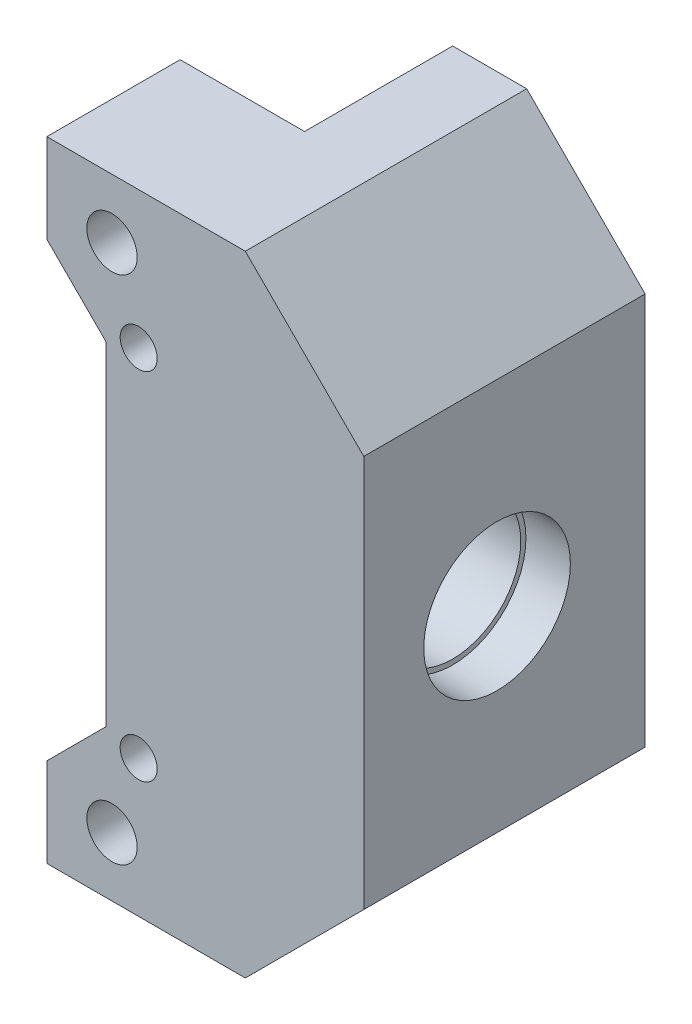
ISO-10303-21;
HEADER;
FILE_DESCRIPTION(('STEP AP214'),'2;1');
FILE_NAME('part.step','',(''),(''),'','','');
FILE_SCHEMA(('AUTOMOTIVE_DESIGN { 1 0 10303 214 1 1 1 1 }'));
ENDSEC;
DATA;
#1=APPLICATION_CONTEXT('core data for automotive mechanical design processes');
#2=APPLICATION_PROTOCOL_DEFINITION('international standard','automotive_design',2000,#1);
#3=PRODUCT_CONTEXT('',#1,'mechanical');
#4=PRODUCT('Part','Part','',(#3));
#5=PRODUCT_RELATED_PRODUCT_CATEGORY('part','',(#4));
#6=PRODUCT_DEFINITION_FORMATION('','',#4);
#7=PRODUCT_DEFINITION_CONTEXT('part definition',#1,'design');
#8=PRODUCT_DEFINITION('design','',#6,#7);
#9=PRODUCT_DEFINITION_SHAPE('','',#8);
#10=(LENGTH_UNIT() NAMED_UNIT(*) SI_UNIT(.MILLI.,.METRE.));
#11=(NAMED_UNIT(*) PLANE_ANGLE_UNIT() SI_UNIT($,.RADIAN.));
#12=(NAMED_UNIT(*) SI_UNIT($,.STERADIAN.) SOLID_ANGLE_UNIT());
#13=UNCERTAINTY_MEASURE_WITH_UNIT(LENGTH_MEASURE(1.E-05),#10,'distance_accuracy_value','');
#14=(GEOMETRIC_REPRESENTATION_CONTEXT(3) GLOBAL_UNCERTAINTY_ASSIGNED_CONTEXT((#13)) GLOBAL_UNIT_ASSIGNED_CONTEXT((#10,
#11,#12)) REPRESENTATION_CONTEXT('',''));
#15=CARTESIAN_POINT('',(0.,0.,0.));
#16=DIRECTION('',(0.,0.,1.));
#17=DIRECTION('',(1.,0.,0.));
#18=AXIS2_PLACEMENT_3D('',#15,#16,#17);
#19=CARTESIAN_POINT('',(51.6154898408293,21.2500000003409,0.));
#20=DIRECTION('',(-1.,0.,0.));
#21=DIRECTION('',(0.,0.,1.));
#22=AXIS2_PLACEMENT_3D('',#19,#20,#21);
#23=CYLINDRICAL_SURFACE('',#22,4.6);
#24=CARTESIAN_POINT('',(43.6154898404884,21.2500000003409,0.));
#25=DIRECTION('',(-1.,0.,0.));
#26=DIRECTION('',(0.,0.,1.));
#27=AXIS2_PLACEMENT_3D('',#24,#25,#26);
#28=CIRCLE('',#27,4.6);
#29=CARTESIAN_POINT('',(43.6154898404884,21.2500000003409,4.6));
#30=VERTEX_POINT('',#29);
#31=EDGE_CURVE('E193',#30,#30,#28,.T.);
#32=ORIENTED_EDGE('',*,*,#31,.T.);
#33=EDGE_LOOP('',(#32));
#34=FACE_BOUND('',#33,.T.);
#35=CARTESIAN_POINT('',(48.6154898408293,21.2500000003409,0.));
#36=DIRECTION('',(1.,0.,0.));
#37=DIRECTION('',(0.,0.,-1.));
#38=AXIS2_PLACEMENT_3D('',#35,#36,#37);
#39=CIRCLE('',#38,4.6);
#40=CARTESIAN_POINT('',(48.6154898408293,21.2500000003409,-4.6));
#41=VERTEX_POINT('',#40);
#42=EDGE_CURVE('E37',#41,#41,#39,.F.);
#43=ORIENTED_EDGE('',*,*,#42,.F.);
#44=EDGE_LOOP('',(#43));
#45=FACE_BOUND('',#44,.T.);
#46=ADVANCED_FACE('F33',(#34,#45),#23,.F.);
#47=CARTESIAN_POINT('',(38.6154898404884,42.5000000003409,-54.4437847177528));
#48=DIRECTION('',(-1.,0.,0.));
#49=DIRECTION('',(0.,0.,1.));
#50=AXIS2_PLACEMENT_3D('',#47,#48,#49);
#51=PLANE('',#50);
#52=DIRECTION('',(0.,0.,1.));
#53=VECTOR('',#52,1.);
#54=CARTESIAN_POINT('',(38.6154898404884,13.2250000003409,0.));
#55=LINE('',#54,#53);
#56=CARTESIAN_POINT('',(38.6154898404884,13.2250000003409,-10.0000000000012));
#57=VERTEX_POINT('',#56);
#58=CARTESIAN_POINT('',(38.6154898404884,13.2250000003409,0.));
#59=VERTEX_POINT('',#58);
#60=EDGE_CURVE('E187',#57,#59,#55,.T.);
#61=ORIENTED_EDGE('',*,*,#60,.F.);
#62=DIRECTION('',(0.,-1.,0.));
#63=VECTOR('',#62,1.);
#64=CARTESIAN_POINT('',(38.6154898404884,42.500000000341,-10.0000000000013));
#65=LINE('',#64,#63);
#66=CARTESIAN_POINT('',(38.6154898404884,3.40928707582259E-10,-10.0000000000012));
#67=VERTEX_POINT('',#66);
#68=EDGE_CURVE('E229',#57,#67,#65,.T.);
#69=ORIENTED_EDGE('',*,*,#68,.T.);
#70=DIRECTION('',(0.,0.,1.));
#71=VECTOR('',#70,1.);
#72=CARTESIAN_POINT('',(38.6154898404884,3.40928707582259E-10,-54.4437847177528));
#73=LINE('',#72,#71);
#74=CARTESIAN_POINT('',(38.6154898404884,3.40928707582259E-10,0.));
#75=VERTEX_POINT('',#74);
#76=EDGE_CURVE('E228',#67,#75,#73,.T.);
#77=ORIENTED_EDGE('',*,*,#76,.T.);
#78=DIRECTION('',(-2.24276025167179E-11,1.,0.));
#79=VECTOR('',#78,1.);
#80=CARTESIAN_POINT('',(38.6154898408287,27.325,0.));
#81=LINE('',#80,#79);
#82=EDGE_CURVE('E286',#75,#59,#81,.T.);
#83=ORIENTED_EDGE('',*,*,#82,.T.);
#84=EDGE_LOOP('',(#61,#69,#77,#83));
#85=FACE_BOUND('',#84,.T.);
#86=ADVANCED_FACE('F337',(#85),#51,.T.);
#87=CARTESIAN_POINT('',(0.,0.,0.));
#88=DIRECTION('',(0.,0.,1.));
#89=DIRECTION('',(1.,0.,0.));
#90=AXIS2_PLACEMENT_3D('',#87,#88,#89);
#91=PLANE('',#90);
#92=CARTESIAN_POINT('',(36.4154898404884,33.2500000003409,0.));
#93=DIRECTION('',(0.,0.,1.));
#94=DIRECTION('',(1.,0.,0.));
#95=AXIS2_PLACEMENT_3D('',#92,#93,#94);
#96=CIRCLE('',#95,1.24999999999999);
#97=CARTESIAN_POINT('',(37.6654898404884,33.2500000003409,0.));
#98=VERTEX_POINT('',#97);
#99=EDGE_CURVE('E315',#98,#98,#96,.T.);
#100=ORIENTED_EDGE('',*,*,#99,.T.);
#101=EDGE_LOOP('',(#100));
#102=FACE_BOUND('',#101,.T.);
#103=CARTESIAN_POINT('',(34.6154898404884,38.5000000003409,0.));
#104=DIRECTION('',(0.,0.,1.));
#105=DIRECTION('',(1.,0.,0.));
#106=AXIS2_PLACEMENT_3D('',#103,#104,#105);
#107=CIRCLE('',#106,1.69999999999999);
#108=CARTESIAN_POINT('',(36.3154898404884,38.5000000003409,0.));
#109=VERTEX_POINT('',#108);
#110=EDGE_CURVE('E243',#109,#109,#107,.T.);
#111=ORIENTED_EDGE('',*,*,#110,.T.);
#112=EDGE_LOOP('',(#111));
#113=FACE_BOUND('',#112,.T.);
#114=CARTESIAN_POINT('',(38.6154898404884,27.2750000003409,0.));
#115=VERTEX_POINT('',#114);
#116=CARTESIAN_POINT('',(38.6154898404884,29.2750000003409,0.));
#117=VERTEX_POINT('',#116);
#118=EDGE_CURVE('E291',#115,#117,#81,.T.);
#119=ORIENTED_EDGE('',*,*,#118,.F.);
#120=DIRECTION('',(-1.,0.,0.));
#121=VECTOR('',#120,1.);
#122=CARTESIAN_POINT('',(55.6567632670842,27.275000000341,0.));
#123=LINE('',#122,#121);
#124=CARTESIAN_POINT('',(34.2154898408287,27.2750000003409,0.));
#125=VERTEX_POINT('',#124);
#126=EDGE_CURVE('E216',#115,#125,#123,.T.);
#127=ORIENTED_EDGE('',*,*,#126,.T.);
#128=DIRECTION('',(0.,-1.,0.));
#129=VECTOR('',#128,1.);
#130=CARTESIAN_POINT('',(34.2154898408287,15.1749999999999,0.));
#131=LINE('',#130,#129);
#132=CARTESIAN_POINT('',(34.2154898404884,32.5000000003409,0.));
#133=VERTEX_POINT('',#132);
#134=EDGE_CURVE('E260',#133,#125,#131,.T.);
#135=ORIENTED_EDGE('',*,*,#134,.F.);
#136=DIRECTION('',(0.707106781186547,-0.707106781186548,0.));
#137=VECTOR('',#136,1.);
#138=CARTESIAN_POINT('',(30.2154898404884,36.5000000003409,0.));
#139=LINE('',#138,#137);
#140=CARTESIAN_POINT('',(30.2154898404884,36.5000000003409,0.));
#141=VERTEX_POINT('',#140);
#142=EDGE_CURVE('E462',#141,#133,#139,.T.);
#143=ORIENTED_EDGE('',*,*,#142,.F.);
#144=DIRECTION('',(0.,-1.,0.));
#145=VECTOR('',#144,1.);
#146=CARTESIAN_POINT('',(30.2154898404884,42.5000000003409,0.));
#147=LINE('',#146,#145);
#148=CARTESIAN_POINT('',(30.2154898404884,42.5000000003409,0.));
#149=VERTEX_POINT('',#148);
#150=EDGE_CURVE('E281',#149,#141,#147,.T.);
#151=ORIENTED_EDGE('',*,*,#150,.F.);
#152=DIRECTION('',(-1.,0.,0.));
#153=VECTOR('',#152,1.);
#154=CARTESIAN_POINT('',(38.6154898404884,42.5000000003409,0.));
#155=LINE('',#154,#153);
#156=CARTESIAN_POINT('',(38.6154898404884,42.5000000003409,0.));
#157=VERTEX_POINT('',#156);
#158=EDGE_CURVE('E458',#157,#149,#155,.T.);
#159=ORIENTED_EDGE('',*,*,#158,.F.);
#160=EDGE_CURVE('E293',#117,#157,#81,.T.);
#161=ORIENTED_EDGE('',*,*,#160,.F.);
#162=EDGE_LOOP('',(#119,#127,#135,#143,#151,#159,#161));
#163=FACE_BOUND('',#162,.T.);
#164=ADVANCED_FACE('F343',(#102,#113,#163),#91,.F.);
#165=CARTESIAN_POINT('',(0.,0.,9.));
#166=DIRECTION('',(0.,0.,1.));
#167=DIRECTION('',(1.,0.,0.));
#168=AXIS2_PLACEMENT_3D('',#165,#166,#167);
#169=PLANE('',#168);
#170=CARTESIAN_POINT('',(36.4154898404884,33.2500000003409,9.));
#171=DIRECTION('',(0.,0.,1.));
#172=DIRECTION('',(1.,0.,0.));
#173=AXIS2_PLACEMENT_3D('',#170,#171,#172);
#174=CIRCLE('',#173,1.24999999999999);
#175=CARTESIAN_POINT('',(37.6654898404884,33.2500000003409,9.));
#176=VERTEX_POINT('',#175);
#177=EDGE_CURVE('E319',#176,#176,#174,.T.);
#178=ORIENTED_EDGE('',*,*,#177,.F.);
#179=EDGE_LOOP('',(#178));
#180=FACE_BOUND('',#179,.T.);
#181=CARTESIAN_POINT('',(36.4154898404884,9.25000000034093,9.));
#182=DIRECTION('',(0.,0.,1.));
#183=DIRECTION('',(1.,0.,0.));
#184=AXIS2_PLACEMENT_3D('',#181,#182,#183);
#185=CIRCLE('',#184,1.24999999999999);
#186=CARTESIAN_POINT('',(37.6654898404884,9.25000000034093,9.));
#187=VERTEX_POINT('',#186);
#188=EDGE_CURVE('E310',#187,#187,#185,.T.);
#189=ORIENTED_EDGE('',*,*,#188,.F.);
#190=EDGE_LOOP('',(#189));
#191=FACE_BOUND('',#190,.T.);
#192=CARTESIAN_POINT('',(34.6154898404884,4.00000000034093,9.));
#193=DIRECTION('',(0.,0.,1.));
#194=DIRECTION('',(1.,0.,0.));
#195=AXIS2_PLACEMENT_3D('',#192,#193,#194);
#196=CIRCLE('',#195,1.7);
#197=CARTESIAN_POINT('',(36.3154898404884,4.00000000034093,9.));
#198=VERTEX_POINT('',#197);
#199=EDGE_CURVE('E250',#198,#198,#196,.T.);
#200=ORIENTED_EDGE('',*,*,#199,.F.);
#201=EDGE_LOOP('',(#200));
#202=FACE_BOUND('',#201,.T.);
#203=DIRECTION('',(0.,1.,0.));
#204=VECTOR('',#203,1.);
#205=CARTESIAN_POINT('',(51.6154898408293,0.,9.));
#206=LINE('',#205,#204);
#207=CARTESIAN_POINT('',(51.6154898408293,8.00000000000003,9.));
#208=VERTEX_POINT('',#207);
#209=CARTESIAN_POINT('',(51.6154898408293,34.5000000003409,9.));
#210=VERTEX_POINT('',#209);
#211=EDGE_CURVE('E219',#208,#210,#206,.T.);
#212=ORIENTED_EDGE('',*,*,#211,.T.);
#213=DIRECTION('',(-0.707106781186549,0.707106781186546,0.));
#214=VECTOR('',#213,1.);
#215=CARTESIAN_POINT('',(43.057744920585,43.0577449205852,9.));
#216=LINE('',#215,#214);
#217=CARTESIAN_POINT('',(43.6154898408293,42.5000000003409,9.));
#218=VERTEX_POINT('',#217);
#219=EDGE_CURVE('E304',#210,#218,#216,.T.);
#220=ORIENTED_EDGE('',*,*,#219,.T.);
#221=DIRECTION('',(-1.,0.,0.));
#222=VECTOR('',#221,1.);
#223=CARTESIAN_POINT('',(38.6154898404884,42.5000000003409,9.));
#224=LINE('',#223,#222);
#225=CARTESIAN_POINT('',(30.2154898404884,42.5000000003409,9.));
#226=VERTEX_POINT('',#225);
#227=EDGE_CURVE('E267',#218,#226,#224,.T.);
#228=ORIENTED_EDGE('',*,*,#227,.T.);
#229=DIRECTION('',(0.,-1.,0.));
#230=VECTOR('',#229,1.);
#231=CARTESIAN_POINT('',(30.2154898404884,42.5000000003409,9.));
#232=LINE('',#231,#230);
#233=CARTESIAN_POINT('',(30.2154898404884,36.5000000003409,9.));
#234=VERTEX_POINT('',#233);
#235=EDGE_CURVE('E269',#226,#234,#232,.T.);
#236=ORIENTED_EDGE('',*,*,#235,.T.);
#237=DIRECTION('',(0.707106781186547,-0.707106781186548,0.));
#238=VECTOR('',#237,1.);
#239=CARTESIAN_POINT('',(30.2154898404884,36.5000000003409,9.));
#240=LINE('',#239,#238);
#241=CARTESIAN_POINT('',(34.2154898404884,32.5000000003409,9.));
#242=VERTEX_POINT('',#241);
#243=EDGE_CURVE('E271',#234,#242,#240,.T.);
#244=ORIENTED_EDGE('',*,*,#243,.T.);
#245=DIRECTION('',(-6.57659648736748E-11,-1.,0.));
#246=VECTOR('',#245,1.);
#247=CARTESIAN_POINT('',(34.2154898408287,15.1749999999999,9.));
#248=LINE('',#247,#246);
#249=CARTESIAN_POINT('',(34.2154898404884,10.0000000003409,9.));
#250=VERTEX_POINT('',#249);
#251=EDGE_CURVE('E256',#242,#250,#248,.T.);
#252=ORIENTED_EDGE('',*,*,#251,.T.);
#253=DIRECTION('',(-0.707106781186546,-0.707106781186549,0.));
#254=VECTOR('',#253,1.);
#255=CARTESIAN_POINT('',(34.2154898404884,10.0000000003409,9.));
#256=LINE('',#255,#254);
#257=CARTESIAN_POINT('',(30.2154898404884,6.00000000034092,9.));
#258=VERTEX_POINT('',#257);
#259=EDGE_CURVE('E259',#250,#258,#256,.T.);
#260=ORIENTED_EDGE('',*,*,#259,.T.);
#261=DIRECTION('',(0.,-1.,0.));
#262=VECTOR('',#261,1.);
#263=CARTESIAN_POINT('',(30.2154898404884,6.00000000034092,9.));
#264=LINE('',#263,#262);
#265=CARTESIAN_POINT('',(30.2154898404884,3.40928690524385E-10,9.));
#266=VERTEX_POINT('',#265);
#267=EDGE_CURVE('E262',#258,#266,#264,.T.);
#268=ORIENTED_EDGE('',*,*,#267,.T.);
#269=DIRECTION('',(1.,0.,0.));
#270=VECTOR('',#269,1.);
#271=CARTESIAN_POINT('',(30.2154898404884,3.40928690524385E-10,9.));
#272=LINE('',#271,#270);
#273=CARTESIAN_POINT('',(43.6154898411702,3.40932165405167E-10,9.));
#274=VERTEX_POINT('',#273);
#275=EDGE_CURVE('E264',#266,#274,#272,.T.);
#276=ORIENTED_EDGE('',*,*,#275,.T.);
#277=DIRECTION('',(0.707106781186546,0.707106781186549,0.));
#278=VECTOR('',#277,1.);
#279=CARTESIAN_POINT('',(21.8077449204147,-21.8077449204146,9.));
#280=LINE('',#279,#278);
#281=EDGE_CURVE('E302',#274,#208,#280,.T.);
#282=ORIENTED_EDGE('',*,*,#281,.T.);
#283=EDGE_LOOP('',(#212,#220,#228,#236,#244,#252,#260,#268,#276,#282));
#284=FACE_BOUND('',#283,.T.);
#285=CARTESIAN_POINT('',(34.6154898404884,38.5000000003409,9.));
#286=DIRECTION('',(0.,0.,1.));
#287=DIRECTION('',(1.,0.,0.));
#288=AXIS2_PLACEMENT_3D('',#285,#286,#287);
#289=CIRCLE('',#288,1.69999999999999);
#290=CARTESIAN_POINT('',(36.3154898404884,38.5000000003409,9.));
#291=VERTEX_POINT('',#290);
#292=EDGE_CURVE('E244',#291,#291,#289,.T.);
#293=ORIENTED_EDGE('',*,*,#292,.F.);
#294=EDGE_LOOP('',(#293));
#295=FACE_BOUND('',#294,.T.);
#296=ADVANCED_FACE('F389',(#180,#191,#202,#284,#295),#169,.T.);
#297=CARTESIAN_POINT('',(36.4154898404884,9.25000000034093,0.));
#298=DIRECTION('',(0.,0.,1.));
#299=DIRECTION('',(1.,0.,0.));
#300=AXIS2_PLACEMENT_3D('',#297,#298,#299);
#301=CIRCLE('',#300,1.24999999999999);
#302=CARTESIAN_POINT('',(37.6654898404884,9.25000000034093,0.));
#303=VERTEX_POINT('',#302);
#304=EDGE_CURVE('E308',#303,#303,#301,.T.);
#305=ORIENTED_EDGE('',*,*,#304,.T.);
#306=EDGE_LOOP('',(#305));
#307=FACE_BOUND('',#306,.T.);
#308=CARTESIAN_POINT('',(34.6154898404884,4.00000000034093,0.));
#309=DIRECTION('',(0.,0.,1.));
#310=DIRECTION('',(1.,0.,0.));
#311=AXIS2_PLACEMENT_3D('',#308,#309,#310);
#312=CIRCLE('',#311,1.7);
#313=CARTESIAN_POINT('',(36.3154898404884,4.00000000034093,0.));
#314=VERTEX_POINT('',#313);
#315=EDGE_CURVE('E247',#314,#314,#312,.T.);
#316=ORIENTED_EDGE('',*,*,#315,.T.);
#317=EDGE_LOOP('',(#316));
#318=FACE_BOUND('',#317,.T.);
#319=CARTESIAN_POINT('',(34.2154898408287,15.2250000003409,0.));
#320=VERTEX_POINT('',#319);
#321=CARTESIAN_POINT('',(34.2154898404884,10.0000000003409,0.));
#322=VERTEX_POINT('',#321);
#323=EDGE_CURVE('E487',#320,#322,#131,.T.);
#324=ORIENTED_EDGE('',*,*,#323,.F.);
#325=DIRECTION('',(-1.,0.,0.));
#326=VECTOR('',#325,1.);
#327=CARTESIAN_POINT('',(55.6567632670842,15.225000000341,0.));
#328=LINE('',#327,#326);
#329=CARTESIAN_POINT('',(38.6154898404884,15.2250000003409,0.));
#330=VERTEX_POINT('',#329);
#331=EDGE_CURVE('E213',#320,#330,#328,.F.);
#332=ORIENTED_EDGE('',*,*,#331,.T.);
#333=DIRECTION('',(0.,-1.,0.));
#334=VECTOR('',#333,1.);
#335=CARTESIAN_POINT('',(38.6154898404884,0.,0.));
#336=LINE('',#335,#334);
#337=EDGE_CURVE('E202',#330,#59,#336,.T.);
#338=ORIENTED_EDGE('',*,*,#337,.T.);
#339=ORIENTED_EDGE('',*,*,#82,.F.);
#340=DIRECTION('',(1.,0.,0.));
#341=VECTOR('',#340,1.);
#342=CARTESIAN_POINT('',(30.2154898404884,3.40928690524385E-10,0.));
#343=LINE('',#342,#341);
#344=CARTESIAN_POINT('',(30.2154898404884,3.40928690524385E-10,0.));
#345=VERTEX_POINT('',#344);
#346=EDGE_CURVE('E278',#345,#75,#343,.T.);
#347=ORIENTED_EDGE('',*,*,#346,.F.);
#348=DIRECTION('',(0.,-1.,0.));
#349=VECTOR('',#348,1.);
#350=CARTESIAN_POINT('',(30.2154898404884,6.00000000034092,0.));
#351=LINE('',#350,#349);
#352=CARTESIAN_POINT('',(30.2154898404884,6.00000000034092,0.));
#353=VERTEX_POINT('',#352);
#354=EDGE_CURVE('E276',#353,#345,#351,.T.);
#355=ORIENTED_EDGE('',*,*,#354,.F.);
#356=DIRECTION('',(-0.707106781186546,-0.707106781186549,0.));
#357=VECTOR('',#356,1.);
#358=CARTESIAN_POINT('',(34.2154898404884,10.0000000003409,0.));
#359=LINE('',#358,#357);
#360=EDGE_CURVE('E253',#322,#353,#359,.T.);
#361=ORIENTED_EDGE('',*,*,#360,.F.);
#362=EDGE_LOOP('',(#324,#332,#338,#339,#347,#355,#361));
#363=FACE_BOUND('',#362,.T.);
#364=ADVANCED_FACE('F392',(#307,#318,#363),#91,.F.);
#365=CARTESIAN_POINT('',(34.2154898404884,10.0000000003409,9.));
#366=DIRECTION('',(0.707106781186549,-0.707106781186546,0.));
#367=DIRECTION('',(0.707106781186546,0.707106781186549,0.));
#368=AXIS2_PLACEMENT_3D('',#365,#366,#367);
#369=PLANE('',#368);
#370=ORIENTED_EDGE('',*,*,#360,.T.);
#371=DIRECTION('',(0.,0.,-1.));
#372=VECTOR('',#371,1.);
#373=CARTESIAN_POINT('',(30.2154898404884,6.00000000034092,9.));
#374=LINE('',#373,#372);
#375=EDGE_CURVE('E447',#258,#353,#374,.T.);
#376=ORIENTED_EDGE('',*,*,#375,.F.);
#377=ORIENTED_EDGE('',*,*,#259,.F.);
#378=DIRECTION('',(0.,0.,-1.));
#379=VECTOR('',#378,1.);
#380=CARTESIAN_POINT('',(34.2154898404884,10.0000000003409,9.));
#381=LINE('',#380,#379);
#382=EDGE_CURVE('E299',#250,#322,#381,.T.);
#383=ORIENTED_EDGE('',*,*,#382,.T.);
#384=EDGE_LOOP('',(#370,#376,#377,#383));
#385=FACE_BOUND('',#384,.T.);
#386=ADVANCED_FACE('F396',(#385),#369,.F.);
#387=CARTESIAN_POINT('',(30.2154898404884,6.00000000034092,9.));
#388=DIRECTION('',(1.,0.,0.));
#389=DIRECTION('',(0.,1.,0.));
#390=AXIS2_PLACEMENT_3D('',#387,#388,#389);
#391=PLANE('',#390);
#392=ORIENTED_EDGE('',*,*,#354,.T.);
#393=DIRECTION('',(0.,0.,-1.));
#394=VECTOR('',#393,1.);
#395=CARTESIAN_POINT('',(30.2154898404884,3.40928690524385E-10,9.));
#396=LINE('',#395,#394);
#397=EDGE_CURVE('E443',#266,#345,#396,.T.);
#398=ORIENTED_EDGE('',*,*,#397,.F.);
#399=ORIENTED_EDGE('',*,*,#267,.F.);
#400=ORIENTED_EDGE('',*,*,#375,.T.);
#401=EDGE_LOOP('',(#392,#398,#399,#400));
#402=FACE_BOUND('',#401,.T.);
#403=ADVANCED_FACE('F414',(#402),#391,.F.);
#404=CARTESIAN_POINT('',(30.2154898404884,3.40928690524385E-10,9.));
#405=DIRECTION('',(0.,1.,0.));
#406=DIRECTION('',(-1.,0.,0.));
#407=AXIS2_PLACEMENT_3D('',#404,#405,#406);
#408=PLANE('',#407);
#409=DIRECTION('',(1.,-2.62252851979476E-11,0.));
#410=VECTOR('',#409,1.);
#411=CARTESIAN_POINT('',(38.6154898404883,3.4092870758226E-10,-10.0000000000012));
#412=LINE('',#411,#410);
#413=CARTESIAN_POINT('',(43.6154898410391,2.09802254626136E-10,-10.0000000000012));
#414=VERTEX_POINT('',#413);
#415=EDGE_CURVE('E222',#67,#414,#412,.T.);
#416=ORIENTED_EDGE('',*,*,#415,.T.);
#417=DIRECTION('',(0.,0.,1.));
#418=VECTOR('',#417,1.);
#419=CARTESIAN_POINT('',(43.6154898411702,3.40928717735755E-10,9.));
#420=LINE('',#419,#418);
#421=EDGE_CURVE('E11',#414,#274,#420,.T.);
#422=ORIENTED_EDGE('',*,*,#421,.T.);
#423=ORIENTED_EDGE('',*,*,#275,.F.);
#424=ORIENTED_EDGE('',*,*,#397,.T.);
#425=ORIENTED_EDGE('',*,*,#346,.T.);
#426=ORIENTED_EDGE('',*,*,#76,.F.);
#427=EDGE_LOOP('',(#416,#422,#423,#424,#425,#426));
#428=FACE_BOUND('',#427,.T.);
#429=ADVANCED_FACE('F411',(#428),#408,.F.);
#430=CARTESIAN_POINT('',(38.6154898404884,42.5000000003409,9.));
#431=DIRECTION('',(0.,-1.,0.));
#432=DIRECTION('',(0.,0.,-1.));
#433=AXIS2_PLACEMENT_3D('',#430,#431,#432);
#434=PLANE('',#433);
#435=ORIENTED_EDGE('',*,*,#227,.F.);
#436=DIRECTION('',(0.,0.,-1.));
#437=VECTOR('',#436,1.);
#438=CARTESIAN_POINT('',(43.6154898408293,42.5000000003409,-10.0000000000013));
#439=LINE('',#438,#437);
#440=CARTESIAN_POINT('',(43.6154898408293,42.5000000003409,-10.0000000000013));
#441=VERTEX_POINT('',#440);
#442=EDGE_CURVE('E58',#218,#441,#439,.T.);
#443=ORIENTED_EDGE('',*,*,#442,.T.);
#444=DIRECTION('',(-1.,0.,0.));
#445=VECTOR('',#444,1.);
#446=CARTESIAN_POINT('',(51.6154898408292,42.5000000003409,-10.0000000000013));
#447=LINE('',#446,#445);
#448=CARTESIAN_POINT('',(38.6154898404884,42.5000000003409,-10.0000000000013));
#449=VERTEX_POINT('',#448);
#450=EDGE_CURVE('E230',#441,#449,#447,.T.);
#451=ORIENTED_EDGE('',*,*,#450,.T.);
#452=DIRECTION('',(0.,0.,1.));
#453=VECTOR('',#452,1.);
#454=CARTESIAN_POINT('',(38.6154898404884,42.5000000003409,-54.4437847177528));
#455=LINE('',#454,#453);
#456=EDGE_CURVE('E232',#449,#157,#455,.T.);
#457=ORIENTED_EDGE('',*,*,#456,.T.);
#458=ORIENTED_EDGE('',*,*,#158,.T.);
#459=DIRECTION('',(0.,0.,-1.));
#460=VECTOR('',#459,1.);
#461=CARTESIAN_POINT('',(30.2154898404884,42.5000000003409,9.));
#462=LINE('',#461,#460);
#463=EDGE_CURVE('E448',#226,#149,#462,.T.);
#464=ORIENTED_EDGE('',*,*,#463,.F.);
#465=EDGE_LOOP('',(#435,#443,#451,#457,#458,#464));
#466=FACE_BOUND('',#465,.T.);
#467=ADVANCED_FACE('F407',(#466),#434,.F.);
#468=CARTESIAN_POINT('',(30.2154898404884,42.5000000003409,9.));
#469=DIRECTION('',(1.,0.,0.));
#470=DIRECTION('',(0.,0.,-1.));
#471=AXIS2_PLACEMENT_3D('',#468,#469,#470);
#472=PLANE('',#471);
#473=ORIENTED_EDGE('',*,*,#150,.T.);
#474=DIRECTION('',(0.,0.,-1.));
#475=VECTOR('',#474,1.);
#476=CARTESIAN_POINT('',(30.2154898404884,36.5000000003409,9.));
#477=LINE('',#476,#475);
#478=EDGE_CURVE('E452',#234,#141,#477,.T.);
#479=ORIENTED_EDGE('',*,*,#478,.F.);
#480=ORIENTED_EDGE('',*,*,#235,.F.);
#481=ORIENTED_EDGE('',*,*,#463,.T.);
#482=EDGE_LOOP('',(#473,#479,#480,#481));
#483=FACE_BOUND('',#482,.T.);
#484=ADVANCED_FACE('F403',(#483),#472,.F.);
#485=CARTESIAN_POINT('',(30.2154898404884,36.5000000003409,9.));
#486=DIRECTION('',(0.707106781186548,0.707106781186547,0.));
#487=DIRECTION('',(-0.707106781186547,0.707106781186548,0.));
#488=AXIS2_PLACEMENT_3D('',#485,#486,#487);
#489=PLANE('',#488);
#490=ORIENTED_EDGE('',*,*,#142,.T.);
#491=DIRECTION('',(0.,0.,-1.));
#492=VECTOR('',#491,1.);
#493=CARTESIAN_POINT('',(34.2154898404884,32.5000000003409,9.));
#494=LINE('',#493,#492);
#495=EDGE_CURVE('E274',#242,#133,#494,.T.);
#496=ORIENTED_EDGE('',*,*,#495,.F.);
#497=ORIENTED_EDGE('',*,*,#243,.F.);
#498=ORIENTED_EDGE('',*,*,#478,.T.);
#499=EDGE_LOOP('',(#490,#496,#497,#498));
#500=FACE_BOUND('',#499,.T.);
#501=ADVANCED_FACE('F399',(#500),#489,.F.);
#502=CARTESIAN_POINT('',(34.2154898408287,15.1749999999999,9.));
#503=DIRECTION('',(1.,0.,0.));
#504=DIRECTION('',(0.,1.,0.));
#505=AXIS2_PLACEMENT_3D('',#502,#503,#504);
#506=PLANE('',#505);
#507=ORIENTED_EDGE('',*,*,#134,.T.);
#508=CARTESIAN_POINT('',(34.2154898408287,21.2500000003409,0.));
#509=DIRECTION('',(-1.,0.,0.));
#510=DIRECTION('',(0.,-1.,0.));
#511=AXIS2_PLACEMENT_3D('',#508,#509,#510);
#512=CIRCLE('',#511,6.025);
#513=EDGE_CURVE('E208',#320,#125,#512,.T.);
#514=ORIENTED_EDGE('',*,*,#513,.F.);
#515=ORIENTED_EDGE('',*,*,#323,.T.);
#516=ORIENTED_EDGE('',*,*,#382,.F.);
#517=ORIENTED_EDGE('',*,*,#251,.F.);
#518=ORIENTED_EDGE('',*,*,#495,.T.);
#519=EDGE_LOOP('',(#507,#514,#515,#516,#517,#518));
#520=FACE_BOUND('',#519,.T.);
#521=ADVANCED_FACE('F387',(#520),#506,.F.);
#522=CARTESIAN_POINT('',(34.6154898404884,4.00000000034093,9.));
#523=DIRECTION('',(0.,0.,-1.));
#524=DIRECTION('',(-1.,0.,0.));
#525=AXIS2_PLACEMENT_3D('',#522,#523,#524);
#526=CYLINDRICAL_SURFACE('',#525,1.7);
#527=ORIENTED_EDGE('',*,*,#199,.T.);
#528=EDGE_LOOP('',(#527));
#529=FACE_BOUND('',#528,.T.);
#530=ORIENTED_EDGE('',*,*,#315,.F.);
#531=EDGE_LOOP('',(#530));
#532=FACE_BOUND('',#531,.T.);
#533=ADVANCED_FACE('F383',(#529,#532),#526,.F.);
#534=CARTESIAN_POINT('',(34.6154898404884,38.5000000003409,9.));
#535=DIRECTION('',(0.,0.,-1.));
#536=DIRECTION('',(-1.,0.,0.));
#537=AXIS2_PLACEMENT_3D('',#534,#535,#536);
#538=CYLINDRICAL_SURFACE('',#537,1.69999999999999);
#539=ORIENTED_EDGE('',*,*,#292,.T.);
#540=EDGE_LOOP('',(#539));
#541=FACE_BOUND('',#540,.T.);
#542=ORIENTED_EDGE('',*,*,#110,.F.);
#543=EDGE_LOOP('',(#542));
#544=FACE_BOUND('',#543,.T.);
#545=ADVANCED_FACE('F380',(#541,#544),#538,.F.);
#546=CARTESIAN_POINT('',(-1.38451015917128,42.4999999999999,-10.0000000000013));
#547=DIRECTION('',(0.,0.,-1.));
#548=DIRECTION('',(0.,1.,0.));
#549=AXIS2_PLACEMENT_3D('',#546,#547,#548);
#550=PLANE('',#549);
#551=ORIENTED_EDGE('',*,*,#450,.F.);
#552=DIRECTION('',(0.707106781186549,-0.707106781186546,0.));
#553=VECTOR('',#552,1.);
#554=CARTESIAN_POINT('',(21.1154898409994,65.0000000001707,-10.0000000000014));
#555=LINE('',#554,#553);
#556=CARTESIAN_POINT('',(51.6154898408293,34.5000000003409,-10.0000000000013));
#557=VERTEX_POINT('',#556);
#558=EDGE_CURVE('E42',#441,#557,#555,.T.);
#559=ORIENTED_EDGE('',*,*,#558,.T.);
#560=DIRECTION('',(0.,1.,0.));
#561=VECTOR('',#560,1.);
#562=CARTESIAN_POINT('',(51.6154898408293,0.,-10.0000000000012));
#563=LINE('',#562,#561);
#564=CARTESIAN_POINT('',(51.6154898408293,8.00000000000001,-10.0000000000012));
#565=VERTEX_POINT('',#564);
#566=EDGE_CURVE('E224',#565,#557,#563,.T.);
#567=ORIENTED_EDGE('',*,*,#566,.F.);
#568=DIRECTION('',(-0.707106781186546,-0.707106781186549,0.));
#569=VECTOR('',#568,1.);
#570=CARTESIAN_POINT('',(42.3654898408291,-1.25000000000025,-10.0000000000012));
#571=LINE('',#570,#569);
#572=EDGE_CURVE('E50',#565,#414,#571,.T.);
#573=ORIENTED_EDGE('',*,*,#572,.T.);
#574=ORIENTED_EDGE('',*,*,#415,.F.);
#575=ORIENTED_EDGE('',*,*,#68,.F.);
#576=DIRECTION('',(-1.,0.,0.));
#577=VECTOR('',#576,1.);
#578=CARTESIAN_POINT('',(43.6154898404884,13.2250000003409,-10.0000000000012));
#579=LINE('',#578,#577);
#580=CARTESIAN_POINT('',(43.6154898404884,13.2250000003409,-10.0000000000012));
#581=VERTEX_POINT('',#580);
#582=EDGE_CURVE('E203',#581,#57,#579,.T.);
#583=ORIENTED_EDGE('',*,*,#582,.F.);
#584=DIRECTION('',(0.,-1.,0.));
#585=VECTOR('',#584,1.);
#586=CARTESIAN_POINT('',(43.6154898404884,13.2250000003409,-10.0000000000012));
#587=LINE('',#586,#585);
#588=CARTESIAN_POINT('',(43.6154898404884,29.2750000003409,-10.0000000000012));
#589=VERTEX_POINT('',#588);
#590=EDGE_CURVE('E183',#589,#581,#587,.T.);
#591=ORIENTED_EDGE('',*,*,#590,.F.);
#592=DIRECTION('',(-1.,0.,0.));
#593=VECTOR('',#592,1.);
#594=CARTESIAN_POINT('',(43.6154898404884,29.2750000003409,-10.0000000000012));
#595=LINE('',#594,#593);
#596=CARTESIAN_POINT('',(38.6154898404884,29.2750000003409,-10.0000000000012));
#597=VERTEX_POINT('',#596);
#598=EDGE_CURVE('E174',#589,#597,#595,.T.);
#599=ORIENTED_EDGE('',*,*,#598,.T.);
#600=EDGE_CURVE('E225',#449,#597,#65,.T.);
#601=ORIENTED_EDGE('',*,*,#600,.F.);
#602=EDGE_LOOP('',(#551,#559,#567,#573,#574,#575,#583,#591,#599,#601));
#603=FACE_BOUND('',#602,.T.);
#604=ADVANCED_FACE('F376',(#603),#550,.T.);
#605=CARTESIAN_POINT('',(51.6154898408293,0.,-54.4437847177528));
#606=DIRECTION('',(1.,0.,0.));
#607=DIRECTION('',(0.,0.,-1.));
#608=AXIS2_PLACEMENT_3D('',#605,#606,#607);
#609=PLANE('',#608);
#610=CARTESIAN_POINT('',(51.6154898408293,21.2500000003409,0.));
#611=DIRECTION('',(1.,0.,0.));
#612=DIRECTION('',(0.,0.,-1.));
#613=AXIS2_PLACEMENT_3D('',#610,#611,#612);
#614=CIRCLE('',#613,4.95);
#615=CARTESIAN_POINT('',(51.6154898408293,21.2500000003409,-4.95));
#616=VERTEX_POINT('',#615);
#617=EDGE_CURVE('E324',#616,#616,#614,.T.);
#618=ORIENTED_EDGE('',*,*,#617,.F.);
#619=EDGE_LOOP('',(#618));
#620=FACE_BOUND('',#619,.T.);
#621=ORIENTED_EDGE('',*,*,#566,.T.);
#622=DIRECTION('',(0.,0.,1.));
#623=VECTOR('',#622,1.);
#624=CARTESIAN_POINT('',(51.6154898408293,34.5000000003409,9.));
#625=LINE('',#624,#623);
#626=EDGE_CURVE('E298',#557,#210,#625,.T.);
#627=ORIENTED_EDGE('',*,*,#626,.T.);
#628=ORIENTED_EDGE('',*,*,#211,.F.);
#629=DIRECTION('',(0.,0.,-1.));
#630=VECTOR('',#629,1.);
#631=CARTESIAN_POINT('',(51.6154898408293,8.00000000000003,-10.0000000000012));
#632=LINE('',#631,#630);
#633=EDGE_CURVE('E296',#208,#565,#632,.T.);
#634=ORIENTED_EDGE('',*,*,#633,.T.);
#635=EDGE_LOOP('',(#621,#627,#628,#634));
#636=FACE_BOUND('',#635,.T.);
#637=ADVANCED_FACE('F372',(#620,#636),#609,.T.);
#638=DIRECTION('',(0.,0.,-1.));
#639=VECTOR('',#638,1.);
#640=CARTESIAN_POINT('',(38.6154898404884,29.2750000003409,0.));
#641=LINE('',#640,#639);
#642=EDGE_CURVE('E190',#117,#597,#641,.T.);
#643=ORIENTED_EDGE('',*,*,#642,.F.);
#644=ORIENTED_EDGE('',*,*,#160,.T.);
#645=ORIENTED_EDGE('',*,*,#456,.F.);
#646=ORIENTED_EDGE('',*,*,#600,.T.);
#647=EDGE_LOOP('',(#643,#644,#645,#646));
#648=FACE_BOUND('',#647,.T.);
#649=ADVANCED_FACE('F346',(#648),#51,.T.);
#650=CARTESIAN_POINT('',(55.6567632670842,21.250000000341,0.));
#651=DIRECTION('',(-1.,0.,0.));
#652=DIRECTION('',(0.,-1.,0.));
#653=AXIS2_PLACEMENT_3D('',#650,#651,#652);
#654=CYLINDRICAL_SURFACE('',#653,6.025);
#655=CARTESIAN_POINT('',(38.6154898404884,21.2500000003409,0.));
#656=DIRECTION('',(-1.,0.,0.));
#657=DIRECTION('',(0.,0.,1.));
#658=AXIS2_PLACEMENT_3D('',#655,#656,#657);
#659=CIRCLE('',#658,6.025);
#660=EDGE_CURVE('E210',#115,#330,#659,.F.);
#661=ORIENTED_EDGE('',*,*,#660,.T.);
#662=ORIENTED_EDGE('',*,*,#331,.F.);
#663=ORIENTED_EDGE('',*,*,#513,.T.);
#664=ORIENTED_EDGE('',*,*,#126,.F.);
#665=EDGE_LOOP('',(#661,#662,#663,#664));
#666=FACE_BOUND('',#665,.T.);
#667=ADVANCED_FACE('F358',(#666),#654,.F.);
#668=CARTESIAN_POINT('',(38.6154898404884,21.2500000003409,0.));
#669=DIRECTION('',(-1.,0.,0.));
#670=DIRECTION('',(0.,0.,1.));
#671=AXIS2_PLACEMENT_3D('',#668,#669,#670);
#672=PLANE('',#671);
#673=CARTESIAN_POINT('',(38.6154898404884,21.2500000003409,0.));
#674=DIRECTION('',(-1.,0.,0.));
#675=DIRECTION('',(0.,0.,1.));
#676=AXIS2_PLACEMENT_3D('',#673,#674,#675);
#677=CIRCLE('',#676,8.025);
#678=EDGE_CURVE('E171',#59,#117,#677,.T.);
#679=ORIENTED_EDGE('',*,*,#678,.F.);
#680=ORIENTED_EDGE('',*,*,#337,.F.);
#681=ORIENTED_EDGE('',*,*,#660,.F.);
#682=ORIENTED_EDGE('',*,*,#118,.T.);
#683=EDGE_LOOP('',(#679,#680,#681,#682));
#684=FACE_BOUND('',#683,.T.);
#685=ADVANCED_FACE('F355',(#684),#672,.F.);
#686=CARTESIAN_POINT('',(43.6154898404884,21.2500000003409,0.));
#687=DIRECTION('',(-1.,0.,0.));
#688=DIRECTION('',(0.,0.,1.));
#689=AXIS2_PLACEMENT_3D('',#686,#687,#688);
#690=CYLINDRICAL_SURFACE('',#689,8.025);
#691=ORIENTED_EDGE('',*,*,#678,.T.);
#692=DIRECTION('',(-1.,0.,0.));
#693=VECTOR('',#692,1.);
#694=CARTESIAN_POINT('',(43.6154898404884,29.2750000003409,0.));
#695=LINE('',#694,#693);
#696=CARTESIAN_POINT('',(43.6154898404884,29.2750000003409,0.));
#697=VERTEX_POINT('',#696);
#698=EDGE_CURVE('E164',#697,#117,#695,.T.);
#699=ORIENTED_EDGE('',*,*,#698,.F.);
#700=CARTESIAN_POINT('',(43.6154898404884,21.2500000003409,0.));
#701=DIRECTION('',(-1.,0.,0.));
#702=DIRECTION('',(0.,0.,1.));
#703=AXIS2_PLACEMENT_3D('',#700,#701,#702);
#704=CIRCLE('',#703,8.025);
#705=CARTESIAN_POINT('',(43.6154898404884,13.2250000003409,0.));
#706=VERTEX_POINT('',#705);
#707=EDGE_CURVE('E168',#706,#697,#704,.T.);
#708=ORIENTED_EDGE('',*,*,#707,.F.);
#709=DIRECTION('',(-1.,0.,0.));
#710=VECTOR('',#709,1.);
#711=CARTESIAN_POINT('',(43.6154898404884,13.2250000003409,0.));
#712=LINE('',#711,#710);
#713=EDGE_CURVE('E200',#706,#59,#712,.T.);
#714=ORIENTED_EDGE('',*,*,#713,.T.);
#715=EDGE_LOOP('',(#691,#699,#708,#714));
#716=FACE_BOUND('',#715,.T.);
#717=ADVANCED_FACE('F166',(#716),#690,.F.);
#718=CARTESIAN_POINT('',(43.6154898404884,13.2250000003409,0.));
#719=DIRECTION('',(0.,-1.,0.));
#720=DIRECTION('',(0.,0.,-1.));
#721=AXIS2_PLACEMENT_3D('',#718,#719,#720);
#722=PLANE('',#721);
#723=ORIENTED_EDGE('',*,*,#60,.T.);
#724=ORIENTED_EDGE('',*,*,#713,.F.);
#725=DIRECTION('',(0.,0.,1.));
#726=VECTOR('',#725,1.);
#727=CARTESIAN_POINT('',(43.6154898404884,13.2250000003409,0.));
#728=LINE('',#727,#726);
#729=EDGE_CURVE('E175',#581,#706,#728,.T.);
#730=ORIENTED_EDGE('',*,*,#729,.F.);
#731=ORIENTED_EDGE('',*,*,#582,.T.);
#732=EDGE_LOOP('',(#723,#724,#730,#731));
#733=FACE_BOUND('',#732,.T.);
#734=ADVANCED_FACE('F360',(#733),#722,.F.);
#735=CARTESIAN_POINT('',(43.6154898404884,29.2750000003409,0.));
#736=DIRECTION('',(0.,1.,0.));
#737=DIRECTION('',(0.,0.,1.));
#738=AXIS2_PLACEMENT_3D('',#735,#736,#737);
#739=PLANE('',#738);
#740=ORIENTED_EDGE('',*,*,#642,.T.);
#741=ORIENTED_EDGE('',*,*,#598,.F.);
#742=DIRECTION('',(0.,0.,-1.));
#743=VECTOR('',#742,1.);
#744=CARTESIAN_POINT('',(43.6154898404884,29.2750000003409,0.));
#745=LINE('',#744,#743);
#746=EDGE_CURVE('E178',#697,#589,#745,.T.);
#747=ORIENTED_EDGE('',*,*,#746,.F.);
#748=ORIENTED_EDGE('',*,*,#698,.T.);
#749=EDGE_LOOP('',(#740,#741,#747,#748));
#750=FACE_BOUND('',#749,.T.);
#751=ADVANCED_FACE('F179',(#750),#739,.F.);
#752=CARTESIAN_POINT('',(43.6154898404884,21.2500000003409,0.));
#753=DIRECTION('',(-1.,0.,0.));
#754=DIRECTION('',(0.,0.,1.));
#755=AXIS2_PLACEMENT_3D('',#752,#753,#754);
#756=PLANE('',#755);
#757=ORIENTED_EDGE('',*,*,#31,.F.);
#758=EDGE_LOOP('',(#757));
#759=FACE_BOUND('',#758,.T.);
#760=ORIENTED_EDGE('',*,*,#707,.T.);
#761=ORIENTED_EDGE('',*,*,#746,.T.);
#762=ORIENTED_EDGE('',*,*,#590,.T.);
#763=ORIENTED_EDGE('',*,*,#729,.T.);
#764=EDGE_LOOP('',(#760,#761,#762,#763));
#765=FACE_BOUND('',#764,.T.);
#766=ADVANCED_FACE('F185',(#759,#765),#756,.T.);
#767=CARTESIAN_POINT('',(51.6154898408293,34.5000000003409,-54.4437847177528));
#768=DIRECTION('',(0.707106781186546,0.707106781186549,0.));
#769=DIRECTION('',(0.,0.,-1.));
#770=AXIS2_PLACEMENT_3D('',#767,#768,#769);
#771=PLANE('',#770);
#772=ORIENTED_EDGE('',*,*,#558,.F.);
#773=ORIENTED_EDGE('',*,*,#442,.F.);
#774=ORIENTED_EDGE('',*,*,#219,.F.);
#775=ORIENTED_EDGE('',*,*,#626,.F.);
#776=EDGE_LOOP('',(#772,#773,#774,#775));
#777=FACE_BOUND('',#776,.T.);
#778=ADVANCED_FACE('F353',(#777),#771,.T.);
#779=CARTESIAN_POINT('',(43.6154898411702,3.40928717735755E-10,9.));
#780=DIRECTION('',(0.707106781186549,-0.707106781186546,0.));
#781=DIRECTION('',(0.,0.,-1.));
#782=AXIS2_PLACEMENT_3D('',#779,#780,#781);
#783=PLANE('',#782);
#784=ORIENTED_EDGE('',*,*,#572,.F.);
#785=ORIENTED_EDGE('',*,*,#633,.F.);
#786=ORIENTED_EDGE('',*,*,#281,.F.);
#787=ORIENTED_EDGE('',*,*,#421,.F.);
#788=EDGE_LOOP('',(#784,#785,#786,#787));
#789=FACE_BOUND('',#788,.T.);
#790=ADVANCED_FACE('F35',(#789),#783,.T.);
#791=CARTESIAN_POINT('',(36.4154898404884,9.25000000034093,9.));
#792=DIRECTION('',(0.,0.,1.));
#793=DIRECTION('',(1.,0.,0.));
#794=AXIS2_PLACEMENT_3D('',#791,#792,#793);
#795=CYLINDRICAL_SURFACE('',#794,1.24999999999999);
#796=ORIENTED_EDGE('',*,*,#188,.T.);
#797=EDGE_LOOP('',(#796));
#798=FACE_BOUND('',#797,.T.);
#799=ORIENTED_EDGE('',*,*,#304,.F.);
#800=EDGE_LOOP('',(#799));
#801=FACE_BOUND('',#800,.T.);
#802=ADVANCED_FACE('F349',(#798,#801),#795,.F.);
#803=CARTESIAN_POINT('',(36.4154898404884,33.2500000003409,9.));
#804=DIRECTION('',(0.,0.,1.));
#805=DIRECTION('',(1.,0.,0.));
#806=AXIS2_PLACEMENT_3D('',#803,#804,#805);
#807=CYLINDRICAL_SURFACE('',#806,1.24999999999999);
#808=ORIENTED_EDGE('',*,*,#177,.T.);
#809=EDGE_LOOP('',(#808));
#810=FACE_BOUND('',#809,.T.);
#811=ORIENTED_EDGE('',*,*,#99,.F.);
#812=EDGE_LOOP('',(#811));
#813=FACE_BOUND('',#812,.T.);
#814=ADVANCED_FACE('F499',(#810,#813),#807,.F.);
#815=CARTESIAN_POINT('',(48.6154898408293,21.2500000003409,0.));
#816=DIRECTION('',(1.,0.,0.));
#817=DIRECTION('',(0.,0.,-1.));
#818=AXIS2_PLACEMENT_3D('',#815,#816,#817);
#819=PLANE('',#818);
#820=CARTESIAN_POINT('',(48.6154898408293,21.2500000003409,0.));
#821=DIRECTION('',(1.,0.,0.));
#822=DIRECTION('',(0.,0.,-1.));
#823=AXIS2_PLACEMENT_3D('',#820,#821,#822);
#824=CIRCLE('',#823,4.95);
#825=CARTESIAN_POINT('',(48.6154898408293,21.2500000003409,-4.95));
#826=VERTEX_POINT('',#825);
#827=EDGE_CURVE('E327',#826,#826,#824,.T.);
#828=ORIENTED_EDGE('',*,*,#827,.T.);
#829=EDGE_LOOP('',(#828));
#830=FACE_BOUND('',#829,.T.);
#831=ORIENTED_EDGE('',*,*,#42,.T.);
#832=EDGE_LOOP('',(#831));
#833=FACE_BOUND('',#832,.T.);
#834=ADVANCED_FACE('F334',(#830,#833),#819,.T.);
#835=CARTESIAN_POINT('',(48.6154898408293,21.2500000003409,0.));
#836=DIRECTION('',(1.,0.,0.));
#837=DIRECTION('',(0.,0.,-1.));
#838=AXIS2_PLACEMENT_3D('',#835,#836,#837);
#839=CYLINDRICAL_SURFACE('',#838,4.95);
#840=ORIENTED_EDGE('',*,*,#827,.F.);
#841=EDGE_LOOP('',(#840));
#842=FACE_BOUND('',#841,.T.);
#843=ORIENTED_EDGE('',*,*,#617,.T.);
#844=EDGE_LOOP('',(#843));
#845=FACE_BOUND('',#844,.T.);
#846=ADVANCED_FACE('F506',(#842,#845),#839,.F.);
#847=CLOSED_SHELL('',(#46,#86,#164,#296,#364,#386,#403,#429,#467,#484,#501,#521,#533,#545,#604,
#637,#649,#667,#685,#717,#734,#751,#766,#778,#790,#802,#814,#834,#846));
#848=MANIFOLD_SOLID_BREP('B2',#847);
#849=ADVANCED_BREP_SHAPE_REPRESENTATION('',(#18,#848),#14);
#850=SHAPE_DEFINITION_REPRESENTATION(#9,#849);
ENDSEC;
END-ISO-10303-21;
